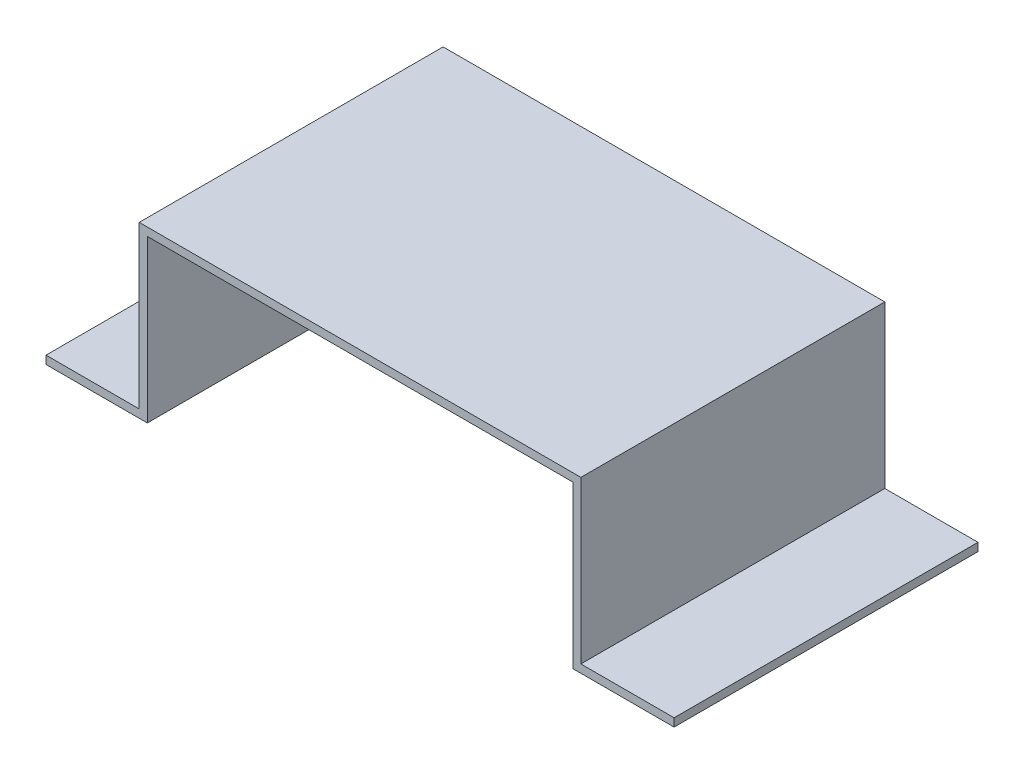
ISO-10303-21;
HEADER;
FILE_DESCRIPTION(('STEP AP214'),'2;1');
FILE_NAME('part.step','',(''),(''),'','','');
FILE_SCHEMA(('AUTOMOTIVE_DESIGN { 1 0 10303 214 1 1 1 1 }'));
ENDSEC;
DATA;
#1=APPLICATION_CONTEXT('core data for automotive mechanical design processes');
#2=APPLICATION_PROTOCOL_DEFINITION('international standard','automotive_design',2000,#1);
#3=PRODUCT_CONTEXT('',#1,'mechanical');
#4=PRODUCT('Part','Part','',(#3));
#5=PRODUCT_RELATED_PRODUCT_CATEGORY('part','',(#4));
#6=PRODUCT_DEFINITION_FORMATION('','',#4);
#7=PRODUCT_DEFINITION_CONTEXT('part definition',#1,'design');
#8=PRODUCT_DEFINITION('design','',#6,#7);
#9=PRODUCT_DEFINITION_SHAPE('','',#8);
#10=(LENGTH_UNIT() NAMED_UNIT(*) SI_UNIT(.MILLI.,.METRE.));
#11=(NAMED_UNIT(*) PLANE_ANGLE_UNIT() SI_UNIT($,.RADIAN.));
#12=(NAMED_UNIT(*) SI_UNIT($,.STERADIAN.) SOLID_ANGLE_UNIT());
#13=UNCERTAINTY_MEASURE_WITH_UNIT(LENGTH_MEASURE(1.E-05),#10,'distance_accuracy_value','');
#14=(GEOMETRIC_REPRESENTATION_CONTEXT(3) GLOBAL_UNCERTAINTY_ASSIGNED_CONTEXT((#13)) GLOBAL_UNIT_ASSIGNED_CONTEXT((#10,
#11,#12)) REPRESENTATION_CONTEXT('',''));
#15=CARTESIAN_POINT('',(0.,0.,0.));
#16=DIRECTION('',(0.,0.,1.));
#17=DIRECTION('',(1.,0.,0.));
#18=AXIS2_PLACEMENT_3D('',#15,#16,#17);
#19=CARTESIAN_POINT('',(0.,2.,75.));
#20=DIRECTION('',(1.,0.,0.));
#21=DIRECTION('',(0.,0.,-1.));
#22=AXIS2_PLACEMENT_3D('',#19,#20,#21);
#23=PLANE('',#22);
#24=DIRECTION('',(0.,-1.,0.));
#25=VECTOR('',#24,1.);
#26=CARTESIAN_POINT('',(0.,2.,0.));
#27=LINE('',#26,#25);
#28=CARTESIAN_POINT('',(0.,2.,0.));
#29=VERTEX_POINT('',#28);
#30=CARTESIAN_POINT('',(0.,0.,0.));
#31=VERTEX_POINT('',#30);
#32=EDGE_CURVE('E153',#29,#31,#27,.T.);
#33=ORIENTED_EDGE('',*,*,#32,.T.);
#34=DIRECTION('',(0.,0.,-1.));
#35=VECTOR('',#34,1.);
#36=CARTESIAN_POINT('',(0.,0.,75.));
#37=LINE('',#36,#35);
#38=CARTESIAN_POINT('',(0.,0.,75.));
#39=VERTEX_POINT('',#38);
#40=EDGE_CURVE('E11',#39,#31,#37,.T.);
#41=ORIENTED_EDGE('',*,*,#40,.F.);
#42=DIRECTION('',(0.,-1.,0.));
#43=VECTOR('',#42,1.);
#44=CARTESIAN_POINT('',(0.,2.,75.));
#45=LINE('',#44,#43);
#46=CARTESIAN_POINT('',(0.,2.,75.));
#47=VERTEX_POINT('',#46);
#48=EDGE_CURVE('E175',#47,#39,#45,.T.);
#49=ORIENTED_EDGE('',*,*,#48,.F.);
#50=DIRECTION('',(0.,0.,-1.));
#51=VECTOR('',#50,1.);
#52=CARTESIAN_POINT('',(0.,2.,75.));
#53=LINE('',#52,#51);
#54=EDGE_CURVE('E149',#47,#29,#53,.T.);
#55=ORIENTED_EDGE('',*,*,#54,.T.);
#56=EDGE_LOOP('',(#33,#41,#49,#55));
#57=FACE_BOUND('',#56,.T.);
#58=ADVANCED_FACE('F33',(#57),#23,.F.);
#59=CARTESIAN_POINT('',(0.,0.,75.));
#60=DIRECTION('',(0.,1.,0.));
#61=DIRECTION('',(0.,0.,1.));
#62=AXIS2_PLACEMENT_3D('',#59,#60,#61);
#63=PLANE('',#62);
#64=DIRECTION('',(1.,0.,0.));
#65=VECTOR('',#64,1.);
#66=CARTESIAN_POINT('',(0.,0.,0.));
#67=LINE('',#66,#65);
#68=CARTESIAN_POINT('',(25.,0.,0.));
#69=VERTEX_POINT('',#68);
#70=EDGE_CURVE('E156',#31,#69,#67,.T.);
#71=ORIENTED_EDGE('',*,*,#70,.T.);
#72=DIRECTION('',(0.,0.,-1.));
#73=VECTOR('',#72,1.);
#74=CARTESIAN_POINT('',(25.,0.,75.));
#75=LINE('',#74,#73);
#76=CARTESIAN_POINT('',(25.,0.,75.));
#77=VERTEX_POINT('',#76);
#78=EDGE_CURVE('E41',#77,#69,#75,.T.);
#79=ORIENTED_EDGE('',*,*,#78,.F.);
#80=DIRECTION('',(1.,0.,0.));
#81=VECTOR('',#80,1.);
#82=CARTESIAN_POINT('',(0.,0.,75.));
#83=LINE('',#82,#81);
#84=EDGE_CURVE('E104',#39,#77,#83,.T.);
#85=ORIENTED_EDGE('',*,*,#84,.F.);
#86=ORIENTED_EDGE('',*,*,#40,.T.);
#87=EDGE_LOOP('',(#71,#79,#85,#86));
#88=FACE_BOUND('',#87,.T.);
#89=ADVANCED_FACE('F253',(#88),#63,.F.);
#90=CARTESIAN_POINT('',(25.,0.,75.));
#91=DIRECTION('',(-1.,0.,0.));
#92=DIRECTION('',(0.,0.,1.));
#93=AXIS2_PLACEMENT_3D('',#90,#91,#92);
#94=PLANE('',#93);
#95=DIRECTION('',(0.,1.,0.));
#96=VECTOR('',#95,1.);
#97=CARTESIAN_POINT('',(25.,0.,0.));
#98=LINE('',#97,#96);
#99=CARTESIAN_POINT('',(25.,39.878,0.));
#100=VERTEX_POINT('',#99);
#101=EDGE_CURVE('E158',#69,#100,#98,.T.);
#102=ORIENTED_EDGE('',*,*,#101,.T.);
#103=DIRECTION('',(0.,0.,-1.));
#104=VECTOR('',#103,1.);
#105=CARTESIAN_POINT('',(25.,39.878,75.));
#106=LINE('',#105,#104);
#107=CARTESIAN_POINT('',(25.,39.878,75.));
#108=VERTEX_POINT('',#107);
#109=EDGE_CURVE('E194',#108,#100,#106,.T.);
#110=ORIENTED_EDGE('',*,*,#109,.F.);
#111=DIRECTION('',(0.,1.,0.));
#112=VECTOR('',#111,1.);
#113=CARTESIAN_POINT('',(25.,0.,75.));
#114=LINE('',#113,#112);
#115=EDGE_CURVE('E202',#77,#108,#114,.T.);
#116=ORIENTED_EDGE('',*,*,#115,.F.);
#117=ORIENTED_EDGE('',*,*,#78,.T.);
#118=EDGE_LOOP('',(#102,#110,#116,#117));
#119=FACE_BOUND('',#118,.T.);
#120=ADVANCED_FACE('F200',(#119),#94,.F.);
#121=CARTESIAN_POINT('',(25.,39.878,75.));
#122=DIRECTION('',(0.,1.,0.));
#123=DIRECTION('',(-1.,0.,0.));
#124=AXIS2_PLACEMENT_3D('',#121,#122,#123);
#125=PLANE('',#124);
#126=DIRECTION('',(1.,0.,0.));
#127=VECTOR('',#126,1.);
#128=CARTESIAN_POINT('',(25.,39.878,0.));
#129=LINE('',#128,#127);
#130=CARTESIAN_POINT('',(130.,39.878,0.));
#131=VERTEX_POINT('',#130);
#132=EDGE_CURVE('E160',#100,#131,#129,.T.);
#133=ORIENTED_EDGE('',*,*,#132,.T.);
#134=DIRECTION('',(0.,0.,-1.));
#135=VECTOR('',#134,1.);
#136=CARTESIAN_POINT('',(130.,39.878,75.));
#137=LINE('',#136,#135);
#138=CARTESIAN_POINT('',(130.,39.878,75.));
#139=VERTEX_POINT('',#138);
#140=EDGE_CURVE('E191',#139,#131,#137,.T.);
#141=ORIENTED_EDGE('',*,*,#140,.F.);
#142=DIRECTION('',(1.,0.,0.));
#143=VECTOR('',#142,1.);
#144=CARTESIAN_POINT('',(25.,39.878,75.));
#145=LINE('',#144,#143);
#146=EDGE_CURVE('E220',#108,#139,#145,.T.);
#147=ORIENTED_EDGE('',*,*,#146,.F.);
#148=ORIENTED_EDGE('',*,*,#109,.T.);
#149=EDGE_LOOP('',(#133,#141,#147,#148));
#150=FACE_BOUND('',#149,.T.);
#151=ADVANCED_FACE('F211',(#150),#125,.F.);
#152=CARTESIAN_POINT('',(130.,0.,75.));
#153=DIRECTION('',(1.,0.,0.));
#154=DIRECTION('',(0.,0.,-1.));
#155=AXIS2_PLACEMENT_3D('',#152,#153,#154);
#156=PLANE('',#155);
#157=DIRECTION('',(0.,-1.,0.));
#158=VECTOR('',#157,1.);
#159=CARTESIAN_POINT('',(130.,0.,0.));
#160=LINE('',#159,#158);
#161=CARTESIAN_POINT('',(130.,0.,0.));
#162=VERTEX_POINT('',#161);
#163=EDGE_CURVE('E162',#131,#162,#160,.T.);
#164=ORIENTED_EDGE('',*,*,#163,.T.);
#165=DIRECTION('',(0.,0.,-1.));
#166=VECTOR('',#165,1.);
#167=CARTESIAN_POINT('',(130.,0.,75.));
#168=LINE('',#167,#166);
#169=CARTESIAN_POINT('',(130.,0.,75.));
#170=VERTEX_POINT('',#169);
#171=EDGE_CURVE('E188',#170,#162,#168,.T.);
#172=ORIENTED_EDGE('',*,*,#171,.F.);
#173=DIRECTION('',(0.,-1.,0.));
#174=VECTOR('',#173,1.);
#175=CARTESIAN_POINT('',(130.,0.,75.));
#176=LINE('',#175,#174);
#177=EDGE_CURVE('E217',#139,#170,#176,.T.);
#178=ORIENTED_EDGE('',*,*,#177,.F.);
#179=ORIENTED_EDGE('',*,*,#140,.T.);
#180=EDGE_LOOP('',(#164,#172,#178,#179));
#181=FACE_BOUND('',#180,.T.);
#182=ADVANCED_FACE('F215',(#181),#156,.F.);
#183=CARTESIAN_POINT('',(155.,0.,75.));
#184=DIRECTION('',(0.,1.,0.));
#185=DIRECTION('',(0.,0.,1.));
#186=AXIS2_PLACEMENT_3D('',#183,#184,#185);
#187=PLANE('',#186);
#188=DIRECTION('',(1.,0.,0.));
#189=VECTOR('',#188,1.);
#190=CARTESIAN_POINT('',(155.,0.,0.));
#191=LINE('',#190,#189);
#192=CARTESIAN_POINT('',(155.,0.,0.));
#193=VERTEX_POINT('',#192);
#194=EDGE_CURVE('E164',#162,#193,#191,.T.);
#195=ORIENTED_EDGE('',*,*,#194,.T.);
#196=DIRECTION('',(0.,0.,-1.));
#197=VECTOR('',#196,1.);
#198=CARTESIAN_POINT('',(155.,0.,75.));
#199=LINE('',#198,#197);
#200=CARTESIAN_POINT('',(155.,0.,75.));
#201=VERTEX_POINT('',#200);
#202=EDGE_CURVE('E185',#201,#193,#199,.T.);
#203=ORIENTED_EDGE('',*,*,#202,.F.);
#204=DIRECTION('',(1.,0.,0.));
#205=VECTOR('',#204,1.);
#206=CARTESIAN_POINT('',(155.,0.,75.));
#207=LINE('',#206,#205);
#208=EDGE_CURVE('E219',#170,#201,#207,.T.);
#209=ORIENTED_EDGE('',*,*,#208,.F.);
#210=ORIENTED_EDGE('',*,*,#171,.T.);
#211=EDGE_LOOP('',(#195,#203,#209,#210));
#212=FACE_BOUND('',#211,.T.);
#213=ADVANCED_FACE('F266',(#212),#187,.F.);
#214=CARTESIAN_POINT('',(155.,2.,75.));
#215=DIRECTION('',(-1.,0.,0.));
#216=DIRECTION('',(0.,0.,1.));
#217=AXIS2_PLACEMENT_3D('',#214,#215,#216);
#218=PLANE('',#217);
#219=DIRECTION('',(0.,1.,0.));
#220=VECTOR('',#219,1.);
#221=CARTESIAN_POINT('',(155.,2.,0.));
#222=LINE('',#221,#220);
#223=CARTESIAN_POINT('',(155.,2.,0.));
#224=VERTEX_POINT('',#223);
#225=EDGE_CURVE('E166',#193,#224,#222,.T.);
#226=ORIENTED_EDGE('',*,*,#225,.T.);
#227=DIRECTION('',(0.,0.,-1.));
#228=VECTOR('',#227,1.);
#229=CARTESIAN_POINT('',(155.,2.,75.));
#230=LINE('',#229,#228);
#231=CARTESIAN_POINT('',(155.,2.,75.));
#232=VERTEX_POINT('',#231);
#233=EDGE_CURVE('E182',#232,#224,#230,.T.);
#234=ORIENTED_EDGE('',*,*,#233,.F.);
#235=DIRECTION('',(0.,1.,0.));
#236=VECTOR('',#235,1.);
#237=CARTESIAN_POINT('',(155.,2.,75.));
#238=LINE('',#237,#236);
#239=EDGE_CURVE('E222',#201,#232,#238,.T.);
#240=ORIENTED_EDGE('',*,*,#239,.F.);
#241=ORIENTED_EDGE('',*,*,#202,.T.);
#242=EDGE_LOOP('',(#226,#234,#240,#241));
#243=FACE_BOUND('',#242,.T.);
#244=ADVANCED_FACE('F269',(#243),#218,.F.);
#245=CARTESIAN_POINT('',(155.,2.,75.));
#246=DIRECTION('',(0.,-1.,0.));
#247=DIRECTION('',(0.,0.,-1.));
#248=AXIS2_PLACEMENT_3D('',#245,#246,#247);
#249=PLANE('',#248);
#250=DIRECTION('',(-1.,0.,0.));
#251=VECTOR('',#250,1.);
#252=CARTESIAN_POINT('',(155.,2.,0.));
#253=LINE('',#252,#251);
#254=CARTESIAN_POINT('',(132.,2.,0.));
#255=VERTEX_POINT('',#254);
#256=EDGE_CURVE('E168',#224,#255,#253,.T.);
#257=ORIENTED_EDGE('',*,*,#256,.T.);
#258=DIRECTION('',(0.,0.,-1.));
#259=VECTOR('',#258,1.);
#260=CARTESIAN_POINT('',(132.,2.,75.));
#261=LINE('',#260,#259);
#262=CARTESIAN_POINT('',(132.,2.,75.));
#263=VERTEX_POINT('',#262);
#264=EDGE_CURVE('E179',#263,#255,#261,.T.);
#265=ORIENTED_EDGE('',*,*,#264,.F.);
#266=DIRECTION('',(-1.,0.,0.));
#267=VECTOR('',#266,1.);
#268=CARTESIAN_POINT('',(155.,2.,75.));
#269=LINE('',#268,#267);
#270=EDGE_CURVE('E228',#232,#263,#269,.T.);
#271=ORIENTED_EDGE('',*,*,#270,.F.);
#272=ORIENTED_EDGE('',*,*,#233,.T.);
#273=EDGE_LOOP('',(#257,#265,#271,#272));
#274=FACE_BOUND('',#273,.T.);
#275=ADVANCED_FACE('F234',(#274),#249,.F.);
#276=CARTESIAN_POINT('',(132.,2.,75.));
#277=DIRECTION('',(-1.,0.,0.));
#278=DIRECTION('',(0.,0.,1.));
#279=AXIS2_PLACEMENT_3D('',#276,#277,#278);
#280=PLANE('',#279);
#281=DIRECTION('',(0.,1.,0.));
#282=VECTOR('',#281,1.);
#283=CARTESIAN_POINT('',(132.,2.,0.));
#284=LINE('',#283,#282);
#285=CARTESIAN_POINT('',(132.,41.878,0.));
#286=VERTEX_POINT('',#285);
#287=EDGE_CURVE('E170',#255,#286,#284,.T.);
#288=ORIENTED_EDGE('',*,*,#287,.T.);
#289=DIRECTION('',(0.,0.,-1.));
#290=VECTOR('',#289,1.);
#291=CARTESIAN_POINT('',(132.,41.878,75.));
#292=LINE('',#291,#290);
#293=CARTESIAN_POINT('',(132.,41.878,75.));
#294=VERTEX_POINT('',#293);
#295=EDGE_CURVE('E144',#294,#286,#292,.T.);
#296=ORIENTED_EDGE('',*,*,#295,.F.);
#297=DIRECTION('',(0.,1.,0.));
#298=VECTOR('',#297,1.);
#299=CARTESIAN_POINT('',(132.,2.,75.));
#300=LINE('',#299,#298);
#301=EDGE_CURVE('E135',#263,#294,#300,.T.);
#302=ORIENTED_EDGE('',*,*,#301,.F.);
#303=ORIENTED_EDGE('',*,*,#264,.T.);
#304=EDGE_LOOP('',(#288,#296,#302,#303));
#305=FACE_BOUND('',#304,.T.);
#306=ADVANCED_FACE('F238',(#305),#280,.F.);
#307=CARTESIAN_POINT('',(23.,41.878,75.));
#308=DIRECTION('',(0.,-1.,0.));
#309=DIRECTION('',(1.,0.,0.));
#310=AXIS2_PLACEMENT_3D('',#307,#308,#309);
#311=PLANE('',#310);
#312=DIRECTION('',(-1.,0.,0.));
#313=VECTOR('',#312,1.);
#314=CARTESIAN_POINT('',(23.,41.878,0.));
#315=LINE('',#314,#313);
#316=CARTESIAN_POINT('',(23.,41.878,0.));
#317=VERTEX_POINT('',#316);
#318=EDGE_CURVE('E143',#286,#317,#315,.T.);
#319=ORIENTED_EDGE('',*,*,#318,.T.);
#320=DIRECTION('',(0.,0.,-1.));
#321=VECTOR('',#320,1.);
#322=CARTESIAN_POINT('',(23.,41.878,75.));
#323=LINE('',#322,#321);
#324=CARTESIAN_POINT('',(23.,41.878,75.));
#325=VERTEX_POINT('',#324);
#326=EDGE_CURVE('E140',#325,#317,#323,.T.);
#327=ORIENTED_EDGE('',*,*,#326,.F.);
#328=DIRECTION('',(-1.,0.,0.));
#329=VECTOR('',#328,1.);
#330=CARTESIAN_POINT('',(23.,41.878,75.));
#331=LINE('',#330,#329);
#332=EDGE_CURVE('E129',#294,#325,#331,.T.);
#333=ORIENTED_EDGE('',*,*,#332,.F.);
#334=ORIENTED_EDGE('',*,*,#295,.T.);
#335=EDGE_LOOP('',(#319,#327,#333,#334));
#336=FACE_BOUND('',#335,.T.);
#337=ADVANCED_FACE('F141',(#336),#311,.F.);
#338=CARTESIAN_POINT('',(23.,2.,75.));
#339=DIRECTION('',(1.,0.,0.));
#340=DIRECTION('',(0.,0.,-1.));
#341=AXIS2_PLACEMENT_3D('',#338,#339,#340);
#342=PLANE('',#341);
#343=DIRECTION('',(0.,-1.,0.));
#344=VECTOR('',#343,1.);
#345=CARTESIAN_POINT('',(23.,2.,0.));
#346=LINE('',#345,#344);
#347=CARTESIAN_POINT('',(23.,2.,0.));
#348=VERTEX_POINT('',#347);
#349=EDGE_CURVE('E90',#317,#348,#346,.T.);
#350=ORIENTED_EDGE('',*,*,#349,.T.);
#351=DIRECTION('',(0.,0.,-1.));
#352=VECTOR('',#351,1.);
#353=CARTESIAN_POINT('',(23.,2.,75.));
#354=LINE('',#353,#352);
#355=CARTESIAN_POINT('',(23.,2.,75.));
#356=VERTEX_POINT('',#355);
#357=EDGE_CURVE('E145',#356,#348,#354,.T.);
#358=ORIENTED_EDGE('',*,*,#357,.F.);
#359=DIRECTION('',(0.,-1.,0.));
#360=VECTOR('',#359,1.);
#361=CARTESIAN_POINT('',(23.,2.,75.));
#362=LINE('',#361,#360);
#363=EDGE_CURVE('E133',#325,#356,#362,.T.);
#364=ORIENTED_EDGE('',*,*,#363,.F.);
#365=ORIENTED_EDGE('',*,*,#326,.T.);
#366=EDGE_LOOP('',(#350,#358,#364,#365));
#367=FACE_BOUND('',#366,.T.);
#368=ADVANCED_FACE('F147',(#367),#342,.F.);
#369=CARTESIAN_POINT('',(0.,2.,75.));
#370=DIRECTION('',(0.,-1.,0.));
#371=DIRECTION('',(0.,0.,-1.));
#372=AXIS2_PLACEMENT_3D('',#369,#370,#371);
#373=PLANE('',#372);
#374=DIRECTION('',(-1.,0.,0.));
#375=VECTOR('',#374,1.);
#376=CARTESIAN_POINT('',(0.,2.,0.));
#377=LINE('',#376,#375);
#378=EDGE_CURVE('E96',#348,#29,#377,.T.);
#379=ORIENTED_EDGE('',*,*,#378,.T.);
#380=ORIENTED_EDGE('',*,*,#54,.F.);
#381=DIRECTION('',(-1.,0.,0.));
#382=VECTOR('',#381,1.);
#383=CARTESIAN_POINT('',(0.,2.,75.));
#384=LINE('',#383,#382);
#385=EDGE_CURVE('E49',#356,#47,#384,.T.);
#386=ORIENTED_EDGE('',*,*,#385,.F.);
#387=ORIENTED_EDGE('',*,*,#357,.T.);
#388=EDGE_LOOP('',(#379,#380,#386,#387));
#389=FACE_BOUND('',#388,.T.);
#390=ADVANCED_FACE('F242',(#389),#373,.F.);
#391=CARTESIAN_POINT('',(0.,0.,75.));
#392=DIRECTION('',(0.,0.,1.));
#393=DIRECTION('',(1.,0.,0.));
#394=AXIS2_PLACEMENT_3D('',#391,#392,#393);
#395=PLANE('',#394);
#396=ORIENTED_EDGE('',*,*,#48,.T.);
#397=ORIENTED_EDGE('',*,*,#84,.T.);
#398=ORIENTED_EDGE('',*,*,#115,.T.);
#399=ORIENTED_EDGE('',*,*,#146,.T.);
#400=ORIENTED_EDGE('',*,*,#177,.T.);
#401=ORIENTED_EDGE('',*,*,#208,.T.);
#402=ORIENTED_EDGE('',*,*,#239,.T.);
#403=ORIENTED_EDGE('',*,*,#270,.T.);
#404=ORIENTED_EDGE('',*,*,#301,.T.);
#405=ORIENTED_EDGE('',*,*,#332,.T.);
#406=ORIENTED_EDGE('',*,*,#363,.T.);
#407=ORIENTED_EDGE('',*,*,#385,.T.);
#408=EDGE_LOOP('',(#396,#397,#398,#399,#400,#401,#402,#403,#404,#405,#406,#407));
#409=FACE_BOUND('',#408,.T.);
#410=ADVANCED_FACE('F131',(#409),#395,.T.);
#411=CARTESIAN_POINT('',(0.,0.,0.));
#412=DIRECTION('',(0.,0.,1.));
#413=DIRECTION('',(1.,0.,0.));
#414=AXIS2_PLACEMENT_3D('',#411,#412,#413);
#415=PLANE('',#414);
#416=ORIENTED_EDGE('',*,*,#32,.F.);
#417=ORIENTED_EDGE('',*,*,#378,.F.);
#418=ORIENTED_EDGE('',*,*,#349,.F.);
#419=ORIENTED_EDGE('',*,*,#318,.F.);
#420=ORIENTED_EDGE('',*,*,#287,.F.);
#421=ORIENTED_EDGE('',*,*,#256,.F.);
#422=ORIENTED_EDGE('',*,*,#225,.F.);
#423=ORIENTED_EDGE('',*,*,#194,.F.);
#424=ORIENTED_EDGE('',*,*,#163,.F.);
#425=ORIENTED_EDGE('',*,*,#132,.F.);
#426=ORIENTED_EDGE('',*,*,#101,.F.);
#427=ORIENTED_EDGE('',*,*,#70,.F.);
#428=EDGE_LOOP('',(#416,#417,#418,#419,#420,#421,#422,#423,#424,#425,#426,#427));
#429=FACE_BOUND('',#428,.T.);
#430=ADVANCED_FACE('F206',(#429),#415,.F.);
#431=CLOSED_SHELL('',(#58,#89,#120,#151,#182,#213,#244,#275,#306,#337,#368,#390,#410,#430));
#432=MANIFOLD_SOLID_BREP('B2',#431);
#433=ADVANCED_BREP_SHAPE_REPRESENTATION('',(#18,#432),#14);
#434=SHAPE_DEFINITION_REPRESENTATION(#9,#433);
ENDSEC;
END-ISO-10303-21;
